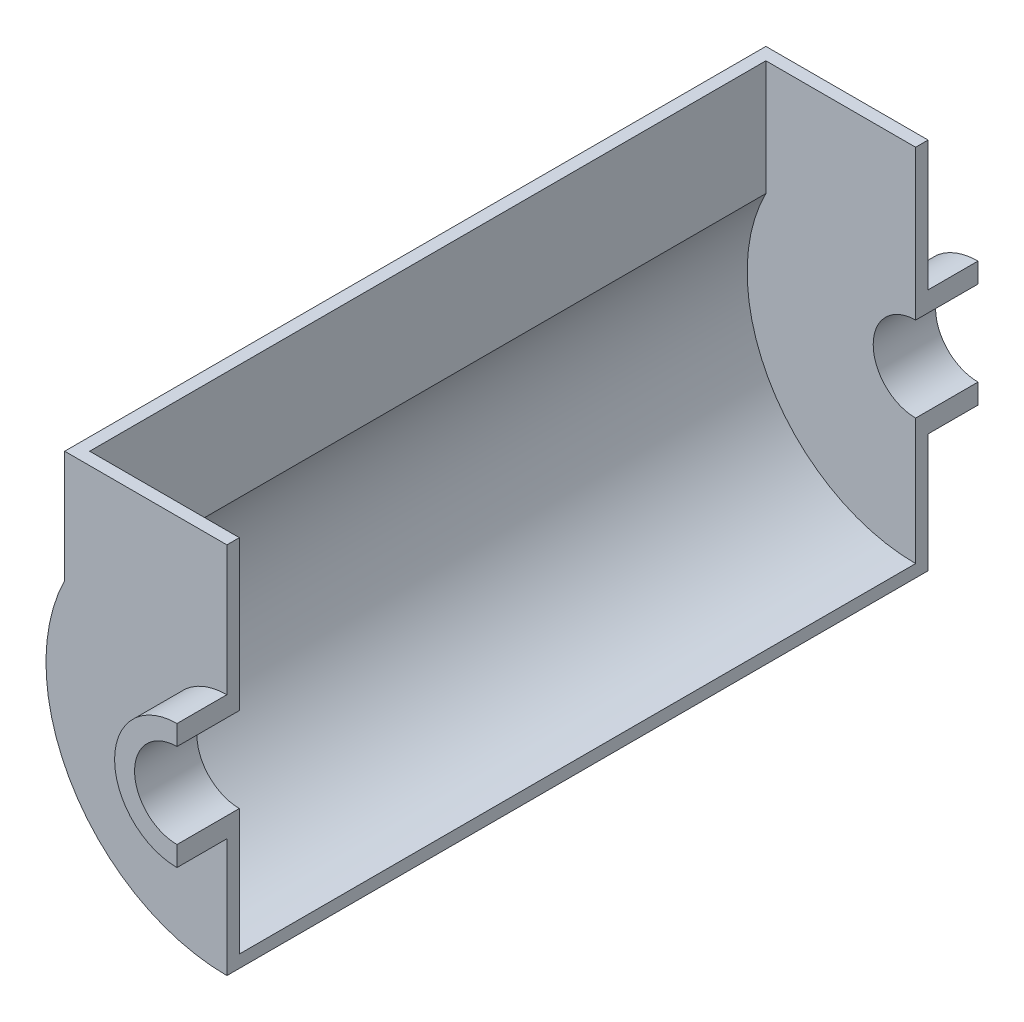
ISO-10303-21;
HEADER;
FILE_DESCRIPTION(('STEP AP214'),'2;1');
FILE_NAME('part.step','',(''),(''),'','','');
FILE_SCHEMA(('AUTOMOTIVE_DESIGN { 1 0 10303 214 1 1 1 1 }'));
ENDSEC;
DATA;
#1=APPLICATION_CONTEXT('core data for automotive mechanical design processes');
#2=APPLICATION_PROTOCOL_DEFINITION('international standard','automotive_design',2000,#1);
#3=PRODUCT_CONTEXT('',#1,'mechanical');
#4=PRODUCT('Part','Part','',(#3));
#5=PRODUCT_RELATED_PRODUCT_CATEGORY('part','',(#4));
#6=PRODUCT_DEFINITION_FORMATION('','',#4);
#7=PRODUCT_DEFINITION_CONTEXT('part definition',#1,'design');
#8=PRODUCT_DEFINITION('design','',#6,#7);
#9=PRODUCT_DEFINITION_SHAPE('','',#8);
#10=(LENGTH_UNIT() NAMED_UNIT(*) SI_UNIT(.MILLI.,.METRE.));
#11=(NAMED_UNIT(*) PLANE_ANGLE_UNIT() SI_UNIT($,.RADIAN.));
#12=(NAMED_UNIT(*) SI_UNIT($,.STERADIAN.) SOLID_ANGLE_UNIT());
#13=UNCERTAINTY_MEASURE_WITH_UNIT(LENGTH_MEASURE(1.E-05),#10,'distance_accuracy_value','');
#14=(GEOMETRIC_REPRESENTATION_CONTEXT(3) GLOBAL_UNCERTAINTY_ASSIGNED_CONTEXT((#13)) GLOBAL_UNIT_ASSIGNED_CONTEXT((#10,
#11,#12)) REPRESENTATION_CONTEXT('',''));
#15=CARTESIAN_POINT('',(0.,0.,0.));
#16=DIRECTION('',(0.,0.,1.));
#17=DIRECTION('',(1.,0.,0.));
#18=AXIS2_PLACEMENT_3D('',#15,#16,#17);
#19=CARTESIAN_POINT('',(0.,0.,-5.));
#20=DIRECTION('',(0.,0.,1.));
#21=DIRECTION('',(1.,0.,0.));
#22=AXIS2_PLACEMENT_3D('',#19,#20,#21);
#23=PLANE('',#22);
#24=CARTESIAN_POINT('',(0.,0.,-5.));
#25=DIRECTION('',(0.,0.,1.));
#26=DIRECTION('',(-1.,0.,0.));
#27=AXIS2_PLACEMENT_3D('',#24,#25,#26);
#28=CIRCLE('',#27,67.5);
#29=CARTESIAN_POINT('',(-60.,30.9232921921324,-5.));
#30=VERTEX_POINT('',#29);
#31=CARTESIAN_POINT('',(0.,-67.5,-5.));
#32=VERTEX_POINT('',#31);
#33=EDGE_CURVE('E209',#30,#32,#28,.T.);
#34=ORIENTED_EDGE('',*,*,#33,.F.);
#35=DIRECTION('',(0.,-1.,0.));
#36=VECTOR('',#35,1.);
#37=CARTESIAN_POINT('',(-60.,77.,-5.));
#38=LINE('',#37,#36);
#39=CARTESIAN_POINT('',(-60.,77.,-5.));
#40=VERTEX_POINT('',#39);
#41=EDGE_CURVE('E57',#40,#30,#38,.T.);
#42=ORIENTED_EDGE('',*,*,#41,.F.);
#43=DIRECTION('',(-1.,0.,0.));
#44=VECTOR('',#43,1.);
#45=CARTESIAN_POINT('',(0.,77.,-5.));
#46=LINE('',#45,#44);
#47=CARTESIAN_POINT('',(0.,77.,-5.));
#48=VERTEX_POINT('',#47);
#49=EDGE_CURVE('E232',#48,#40,#46,.T.);
#50=ORIENTED_EDGE('',*,*,#49,.F.);
#51=DIRECTION('',(0.,1.,0.));
#52=VECTOR('',#51,1.);
#53=CARTESIAN_POINT('',(0.,25.,-5.));
#54=LINE('',#53,#52);
#55=CARTESIAN_POINT('',(0.,17.,-5.));
#56=VERTEX_POINT('',#55);
#57=EDGE_CURVE('E290',#56,#48,#54,.T.);
#58=ORIENTED_EDGE('',*,*,#57,.F.);
#59=CARTESIAN_POINT('',(0.,0.,-5.));
#60=DIRECTION('',(0.,0.,-1.));
#61=DIRECTION('',(1.,0.,0.));
#62=AXIS2_PLACEMENT_3D('',#59,#60,#61);
#63=CIRCLE('',#62,17.);
#64=CARTESIAN_POINT('',(0.,-17.,-5.));
#65=VERTEX_POINT('',#64);
#66=EDGE_CURVE('E286',#65,#56,#63,.T.);
#67=ORIENTED_EDGE('',*,*,#66,.F.);
#68=DIRECTION('',(0.,1.,0.));
#69=VECTOR('',#68,1.);
#70=CARTESIAN_POINT('',(0.,-17.,-5.));
#71=LINE('',#70,#69);
#72=EDGE_CURVE('E63',#32,#65,#71,.T.);
#73=ORIENTED_EDGE('',*,*,#72,.F.);
#74=EDGE_LOOP('',(#34,#42,#50,#58,#67,#73));
#75=FACE_BOUND('',#74,.T.);
#76=ADVANCED_FACE('F39',(#75),#23,.F.);
#77=CARTESIAN_POINT('',(0.,0.,-5.));
#78=DIRECTION('',(0.,0.,1.));
#79=DIRECTION('',(1.,0.,0.));
#80=AXIS2_PLACEMENT_3D('',#77,#78,#79);
#81=CYLINDRICAL_SURFACE('',#80,17.);
#82=DIRECTION('',(0.,0.,1.));
#83=VECTOR('',#82,1.);
#84=CARTESIAN_POINT('',(0.,17.,-5.));
#85=LINE('',#84,#83);
#86=CARTESIAN_POINT('',(0.,17.,20.));
#87=VERTEX_POINT('',#86);
#88=EDGE_CURVE('E43',#56,#87,#85,.T.);
#89=ORIENTED_EDGE('',*,*,#88,.T.);
#90=CARTESIAN_POINT('',(0.,0.,20.));
#91=DIRECTION('',(0.,0.,-1.));
#92=DIRECTION('',(1.,0.,0.));
#93=AXIS2_PLACEMENT_3D('',#90,#91,#92);
#94=CIRCLE('',#93,17.);
#95=CARTESIAN_POINT('',(0.,-17.,20.));
#96=VERTEX_POINT('',#95);
#97=EDGE_CURVE('E262',#96,#87,#94,.T.);
#98=ORIENTED_EDGE('',*,*,#97,.F.);
#99=DIRECTION('',(0.,0.,1.));
#100=VECTOR('',#99,1.);
#101=CARTESIAN_POINT('',(0.,-17.,-5.));
#102=LINE('',#101,#100);
#103=EDGE_CURVE('E11',#65,#96,#102,.T.);
#104=ORIENTED_EDGE('',*,*,#103,.F.);
#105=ORIENTED_EDGE('',*,*,#66,.T.);
#106=EDGE_LOOP('',(#89,#98,#104,#105));
#107=FACE_BOUND('',#106,.T.);
#108=ADVANCED_FACE('F41',(#107),#81,.F.);
#109=CARTESIAN_POINT('',(0.,-17.,-5.));
#110=DIRECTION('',(1.,0.,0.));
#111=DIRECTION('',(0.,0.,-1.));
#112=AXIS2_PLACEMENT_3D('',#109,#110,#111);
#113=PLANE('',#112);
#114=ORIENTED_EDGE('',*,*,#103,.T.);
#115=DIRECTION('',(0.,1.,0.));
#116=VECTOR('',#115,1.);
#117=CARTESIAN_POINT('',(0.,-17.,20.));
#118=LINE('',#117,#116);
#119=CARTESIAN_POINT('',(0.,-25.,20.));
#120=VERTEX_POINT('',#119);
#121=EDGE_CURVE('E282',#120,#96,#118,.T.);
#122=ORIENTED_EDGE('',*,*,#121,.F.);
#123=DIRECTION('',(0.,0.,1.));
#124=VECTOR('',#123,1.);
#125=CARTESIAN_POINT('',(0.,-25.,-5.));
#126=LINE('',#125,#124);
#127=CARTESIAN_POINT('',(0.,-25.,0.));
#128=VERTEX_POINT('',#127);
#129=EDGE_CURVE('E49',#128,#120,#126,.T.);
#130=ORIENTED_EDGE('',*,*,#129,.F.);
#131=DIRECTION('',(0.,1.,0.));
#132=VECTOR('',#131,1.);
#133=CARTESIAN_POINT('',(0.,-25.,0.));
#134=LINE('',#133,#132);
#135=CARTESIAN_POINT('',(0.,-72.5,0.));
#136=VERTEX_POINT('',#135);
#137=EDGE_CURVE('E236',#136,#128,#134,.T.);
#138=ORIENTED_EDGE('',*,*,#137,.F.);
#139=DIRECTION('',(0.,0.,1.));
#140=VECTOR('',#139,1.);
#141=CARTESIAN_POINT('',(0.,-72.5,-5.));
#142=LINE('',#141,#140);
#143=CARTESIAN_POINT('',(0.,-72.5,-281.));
#144=VERTEX_POINT('',#143);
#145=EDGE_CURVE('E259',#144,#136,#142,.T.);
#146=ORIENTED_EDGE('',*,*,#145,.F.);
#147=DIRECTION('',(0.,1.,0.));
#148=VECTOR('',#147,1.);
#149=CARTESIAN_POINT('',(0.,-25.,-281.));
#150=LINE('',#149,#148);
#151=CARTESIAN_POINT('',(0.,-25.,-281.));
#152=VERTEX_POINT('',#151);
#153=EDGE_CURVE('E168',#144,#152,#150,.T.);
#154=ORIENTED_EDGE('',*,*,#153,.T.);
#155=DIRECTION('',(0.,0.,-1.));
#156=VECTOR('',#155,1.);
#157=CARTESIAN_POINT('',(0.,-25.,-276.));
#158=LINE('',#157,#156);
#159=CARTESIAN_POINT('',(0.,-25.,-301.));
#160=VERTEX_POINT('',#159);
#161=EDGE_CURVE('E199',#152,#160,#158,.T.);
#162=ORIENTED_EDGE('',*,*,#161,.T.);
#163=DIRECTION('',(0.,1.,0.));
#164=VECTOR('',#163,1.);
#165=CARTESIAN_POINT('',(0.,-17.,-301.));
#166=LINE('',#165,#164);
#167=CARTESIAN_POINT('',(0.,-17.,-301.));
#168=VERTEX_POINT('',#167);
#169=EDGE_CURVE('E191',#160,#168,#166,.T.);
#170=ORIENTED_EDGE('',*,*,#169,.T.);
#171=DIRECTION('',(0.,0.,-1.));
#172=VECTOR('',#171,1.);
#173=CARTESIAN_POINT('',(0.,-17.,-276.));
#174=LINE('',#173,#172);
#175=CARTESIAN_POINT('',(0.,-17.,-276.));
#176=VERTEX_POINT('',#175);
#177=EDGE_CURVE('E195',#176,#168,#174,.T.);
#178=ORIENTED_EDGE('',*,*,#177,.F.);
#179=DIRECTION('',(0.,1.,0.));
#180=VECTOR('',#179,1.);
#181=CARTESIAN_POINT('',(0.,-17.,-276.));
#182=LINE('',#181,#180);
#183=CARTESIAN_POINT('',(0.,-67.5,-276.));
#184=VERTEX_POINT('',#183);
#185=EDGE_CURVE('E185',#184,#176,#182,.T.);
#186=ORIENTED_EDGE('',*,*,#185,.F.);
#187=DIRECTION('',(0.,0.,1.));
#188=VECTOR('',#187,1.);
#189=CARTESIAN_POINT('',(0.,-67.5,-442.152038807834));
#190=LINE('',#189,#188);
#191=EDGE_CURVE('E213',#184,#32,#190,.T.);
#192=ORIENTED_EDGE('',*,*,#191,.T.);
#193=ORIENTED_EDGE('',*,*,#72,.T.);
#194=EDGE_LOOP('',(#114,#122,#130,#138,#146,#154,#162,#170,#178,#186,#192,#193));
#195=FACE_BOUND('',#194,.T.);
#196=ADVANCED_FACE('F313',(#195),#113,.T.);
#197=CARTESIAN_POINT('',(0.,0.,-5.));
#198=DIRECTION('',(0.,0.,1.));
#199=DIRECTION('',(1.,0.,0.));
#200=AXIS2_PLACEMENT_3D('',#197,#198,#199);
#201=CYLINDRICAL_SURFACE('',#200,25.);
#202=CARTESIAN_POINT('',(0.,0.,0.));
#203=DIRECTION('',(0.,0.,-1.));
#204=DIRECTION('',(1.,0.,0.));
#205=AXIS2_PLACEMENT_3D('',#202,#203,#204);
#206=CIRCLE('',#205,25.);
#207=CARTESIAN_POINT('',(0.,25.,0.));
#208=VERTEX_POINT('',#207);
#209=EDGE_CURVE('E221',#128,#208,#206,.T.);
#210=ORIENTED_EDGE('',*,*,#209,.F.);
#211=ORIENTED_EDGE('',*,*,#129,.T.);
#212=CARTESIAN_POINT('',(0.,0.,20.));
#213=DIRECTION('',(0.,0.,1.));
#214=DIRECTION('',(1.,0.,0.));
#215=AXIS2_PLACEMENT_3D('',#212,#213,#214);
#216=CIRCLE('',#215,25.);
#217=CARTESIAN_POINT('',(0.,25.,20.));
#218=VERTEX_POINT('',#217);
#219=EDGE_CURVE('E278',#218,#120,#216,.T.);
#220=ORIENTED_EDGE('',*,*,#219,.F.);
#221=DIRECTION('',(0.,0.,1.));
#222=VECTOR('',#221,1.);
#223=CARTESIAN_POINT('',(0.,25.,-5.));
#224=LINE('',#223,#222);
#225=EDGE_CURVE('E296',#208,#218,#224,.T.);
#226=ORIENTED_EDGE('',*,*,#225,.F.);
#227=EDGE_LOOP('',(#210,#211,#220,#226));
#228=FACE_BOUND('',#227,.T.);
#229=ADVANCED_FACE('F320',(#228),#201,.T.);
#230=CARTESIAN_POINT('',(0.,25.,-5.));
#231=DIRECTION('',(1.,0.,0.));
#232=DIRECTION('',(0.,0.,-1.));
#233=AXIS2_PLACEMENT_3D('',#230,#231,#232);
#234=PLANE('',#233);
#235=ORIENTED_EDGE('',*,*,#57,.T.);
#236=DIRECTION('',(0.,0.,1.));
#237=VECTOR('',#236,1.);
#238=CARTESIAN_POINT('',(0.,77.,-5.));
#239=LINE('',#238,#237);
#240=CARTESIAN_POINT('',(0.,77.,0.));
#241=VERTEX_POINT('',#240);
#242=EDGE_CURVE('E235',#48,#241,#239,.T.);
#243=ORIENTED_EDGE('',*,*,#242,.T.);
#244=DIRECTION('',(0.,1.,0.));
#245=VECTOR('',#244,1.);
#246=CARTESIAN_POINT('',(0.,25.,0.));
#247=LINE('',#246,#245);
#248=EDGE_CURVE('E240',#208,#241,#247,.T.);
#249=ORIENTED_EDGE('',*,*,#248,.F.);
#250=ORIENTED_EDGE('',*,*,#225,.T.);
#251=DIRECTION('',(0.,1.,0.));
#252=VECTOR('',#251,1.);
#253=CARTESIAN_POINT('',(0.,25.,20.));
#254=LINE('',#253,#252);
#255=EDGE_CURVE('E274',#87,#218,#254,.T.);
#256=ORIENTED_EDGE('',*,*,#255,.F.);
#257=ORIENTED_EDGE('',*,*,#88,.F.);
#258=EDGE_LOOP('',(#235,#243,#249,#250,#256,#257));
#259=FACE_BOUND('',#258,.T.);
#260=ADVANCED_FACE('F306',(#259),#234,.T.);
#261=CARTESIAN_POINT('',(0.,0.,20.));
#262=DIRECTION('',(0.,0.,1.));
#263=DIRECTION('',(1.,0.,0.));
#264=AXIS2_PLACEMENT_3D('',#261,#262,#263);
#265=PLANE('',#264);
#266=ORIENTED_EDGE('',*,*,#97,.T.);
#267=ORIENTED_EDGE('',*,*,#255,.T.);
#268=ORIENTED_EDGE('',*,*,#219,.T.);
#269=ORIENTED_EDGE('',*,*,#121,.T.);
#270=EDGE_LOOP('',(#266,#267,#268,#269));
#271=FACE_BOUND('',#270,.T.);
#272=ADVANCED_FACE('F309',(#271),#265,.T.);
#273=CARTESIAN_POINT('',(0.,0.,-5.));
#274=DIRECTION('',(0.,0.,1.));
#275=DIRECTION('',(1.,0.,0.));
#276=AXIS2_PLACEMENT_3D('',#273,#274,#275);
#277=CYLINDRICAL_SURFACE('',#276,72.5);
#278=CARTESIAN_POINT('',(0.,0.,0.));
#279=DIRECTION('',(0.,0.,1.));
#280=DIRECTION('',(1.,0.,0.));
#281=AXIS2_PLACEMENT_3D('',#278,#279,#280);
#282=CIRCLE('',#281,72.5);
#283=CARTESIAN_POINT('',(-65.,32.1130814466628,0.));
#284=VERTEX_POINT('',#283);
#285=EDGE_CURVE('E252',#284,#136,#282,.T.);
#286=ORIENTED_EDGE('',*,*,#285,.F.);
#287=DIRECTION('',(0.,0.,1.));
#288=VECTOR('',#287,1.);
#289=CARTESIAN_POINT('',(-65.,32.1130814466628,-5.));
#290=LINE('',#289,#288);
#291=CARTESIAN_POINT('',(-65.,32.1130814466628,-281.));
#292=VERTEX_POINT('',#291);
#293=EDGE_CURVE('E263',#292,#284,#290,.T.);
#294=ORIENTED_EDGE('',*,*,#293,.F.);
#295=CARTESIAN_POINT('',(0.,0.,-281.));
#296=DIRECTION('',(0.,0.,1.));
#297=DIRECTION('',(1.,0.,0.));
#298=AXIS2_PLACEMENT_3D('',#295,#296,#297);
#299=CIRCLE('',#298,72.5);
#300=EDGE_CURVE('E390',#292,#144,#299,.T.);
#301=ORIENTED_EDGE('',*,*,#300,.T.);
#302=ORIENTED_EDGE('',*,*,#145,.T.);
#303=EDGE_LOOP('',(#286,#294,#301,#302));
#304=FACE_BOUND('',#303,.T.);
#305=ADVANCED_FACE('F336',(#304),#277,.T.);
#306=CARTESIAN_POINT('',(-65.,77.,-5.));
#307=DIRECTION('',(-1.,0.,0.));
#308=DIRECTION('',(0.,-1.,0.));
#309=AXIS2_PLACEMENT_3D('',#306,#307,#308);
#310=PLANE('',#309);
#311=DIRECTION('',(0.,-1.,0.));
#312=VECTOR('',#311,1.);
#313=CARTESIAN_POINT('',(-65.,77.,0.));
#314=LINE('',#313,#312);
#315=CARTESIAN_POINT('',(-65.,77.,0.));
#316=VERTEX_POINT('',#315);
#317=EDGE_CURVE('E248',#316,#284,#314,.T.);
#318=ORIENTED_EDGE('',*,*,#317,.F.);
#319=DIRECTION('',(0.,0.,1.));
#320=VECTOR('',#319,1.);
#321=CARTESIAN_POINT('',(-65.,77.,-5.));
#322=LINE('',#321,#320);
#323=CARTESIAN_POINT('',(-65.,77.,-281.));
#324=VERTEX_POINT('',#323);
#325=EDGE_CURVE('E266',#324,#316,#322,.T.);
#326=ORIENTED_EDGE('',*,*,#325,.F.);
#327=DIRECTION('',(0.,-1.,0.));
#328=VECTOR('',#327,1.);
#329=CARTESIAN_POINT('',(-65.,77.,-281.));
#330=LINE('',#329,#328);
#331=EDGE_CURVE('E393',#324,#292,#330,.T.);
#332=ORIENTED_EDGE('',*,*,#331,.T.);
#333=ORIENTED_EDGE('',*,*,#293,.T.);
#334=EDGE_LOOP('',(#318,#326,#332,#333));
#335=FACE_BOUND('',#334,.T.);
#336=ADVANCED_FACE('F339',(#335),#310,.T.);
#337=CARTESIAN_POINT('',(0.,77.,-5.));
#338=DIRECTION('',(0.,1.,0.));
#339=DIRECTION('',(-1.,0.,0.));
#340=AXIS2_PLACEMENT_3D('',#337,#338,#339);
#341=PLANE('',#340);
#342=DIRECTION('',(-1.,0.,0.));
#343=VECTOR('',#342,1.);
#344=CARTESIAN_POINT('',(0.,77.,0.));
#345=LINE('',#344,#343);
#346=EDGE_CURVE('E244',#241,#316,#345,.T.);
#347=ORIENTED_EDGE('',*,*,#346,.F.);
#348=ORIENTED_EDGE('',*,*,#242,.F.);
#349=ORIENTED_EDGE('',*,*,#49,.T.);
#350=DIRECTION('',(0.,0.,1.));
#351=VECTOR('',#350,1.);
#352=CARTESIAN_POINT('',(-60.,77.,-442.152038807834));
#353=LINE('',#352,#351);
#354=CARTESIAN_POINT('',(-60.,77.,-276.));
#355=VERTEX_POINT('',#354);
#356=EDGE_CURVE('E163',#355,#40,#353,.T.);
#357=ORIENTED_EDGE('',*,*,#356,.F.);
#358=DIRECTION('',(-1.,0.,0.));
#359=VECTOR('',#358,1.);
#360=CARTESIAN_POINT('',(0.,77.,-276.));
#361=LINE('',#360,#359);
#362=CARTESIAN_POINT('',(0.,77.,-276.));
#363=VERTEX_POINT('',#362);
#364=EDGE_CURVE('E155',#363,#355,#361,.T.);
#365=ORIENTED_EDGE('',*,*,#364,.F.);
#366=DIRECTION('',(0.,0.,-1.));
#367=VECTOR('',#366,1.);
#368=CARTESIAN_POINT('',(0.,77.,-276.));
#369=LINE('',#368,#367);
#370=CARTESIAN_POINT('',(0.,77.,-281.));
#371=VERTEX_POINT('',#370);
#372=EDGE_CURVE('E160',#363,#371,#369,.T.);
#373=ORIENTED_EDGE('',*,*,#372,.T.);
#374=DIRECTION('',(-1.,0.,0.));
#375=VECTOR('',#374,1.);
#376=CARTESIAN_POINT('',(0.,77.,-281.));
#377=LINE('',#376,#375);
#378=EDGE_CURVE('E412',#371,#324,#377,.T.);
#379=ORIENTED_EDGE('',*,*,#378,.T.);
#380=ORIENTED_EDGE('',*,*,#325,.T.);
#381=EDGE_LOOP('',(#347,#348,#349,#357,#365,#373,#379,#380));
#382=FACE_BOUND('',#381,.T.);
#383=ADVANCED_FACE('F158',(#382),#341,.T.);
#384=CARTESIAN_POINT('',(0.,0.,0.));
#385=DIRECTION('',(0.,0.,1.));
#386=DIRECTION('',(1.,0.,0.));
#387=AXIS2_PLACEMENT_3D('',#384,#385,#386);
#388=PLANE('',#387);
#389=ORIENTED_EDGE('',*,*,#209,.T.);
#390=ORIENTED_EDGE('',*,*,#248,.T.);
#391=ORIENTED_EDGE('',*,*,#346,.T.);
#392=ORIENTED_EDGE('',*,*,#317,.T.);
#393=ORIENTED_EDGE('',*,*,#285,.T.);
#394=ORIENTED_EDGE('',*,*,#137,.T.);
#395=EDGE_LOOP('',(#389,#390,#391,#392,#393,#394));
#396=FACE_BOUND('',#395,.T.);
#397=ADVANCED_FACE('F318',(#396),#388,.T.);
#398=CARTESIAN_POINT('',(-60.,77.,-442.152038807834));
#399=DIRECTION('',(-1.,0.,0.));
#400=DIRECTION('',(0.,0.,1.));
#401=AXIS2_PLACEMENT_3D('',#398,#399,#400);
#402=PLANE('',#401);
#403=DIRECTION('',(0.,-1.,0.));
#404=VECTOR('',#403,1.);
#405=CARTESIAN_POINT('',(-60.,77.,-276.));
#406=LINE('',#405,#404);
#407=CARTESIAN_POINT('',(-60.,30.9232921921324,-276.));
#408=VERTEX_POINT('',#407);
#409=EDGE_CURVE('E222',#355,#408,#406,.T.);
#410=ORIENTED_EDGE('',*,*,#409,.F.);
#411=ORIENTED_EDGE('',*,*,#356,.T.);
#412=ORIENTED_EDGE('',*,*,#41,.T.);
#413=DIRECTION('',(0.,0.,1.));
#414=VECTOR('',#413,1.);
#415=CARTESIAN_POINT('',(-60.,30.9232921921324,-442.152038807834));
#416=LINE('',#415,#414);
#417=EDGE_CURVE('E214',#408,#30,#416,.T.);
#418=ORIENTED_EDGE('',*,*,#417,.F.);
#419=EDGE_LOOP('',(#410,#411,#412,#418));
#420=FACE_BOUND('',#419,.T.);
#421=ADVANCED_FACE('F348',(#420),#402,.F.);
#422=CARTESIAN_POINT('',(0.,0.,-442.152038807834));
#423=DIRECTION('',(0.,0.,1.));
#424=DIRECTION('',(1.,0.,0.));
#425=AXIS2_PLACEMENT_3D('',#422,#423,#424);
#426=CYLINDRICAL_SURFACE('',#425,67.5);
#427=CARTESIAN_POINT('',(0.,0.,-276.));
#428=DIRECTION('',(0.,0.,-1.));
#429=DIRECTION('',(-1.,0.,0.));
#430=AXIS2_PLACEMENT_3D('',#427,#428,#429);
#431=CIRCLE('',#430,67.5);
#432=EDGE_CURVE('E217',#408,#184,#431,.F.);
#433=ORIENTED_EDGE('',*,*,#432,.F.);
#434=ORIENTED_EDGE('',*,*,#417,.T.);
#435=ORIENTED_EDGE('',*,*,#33,.T.);
#436=ORIENTED_EDGE('',*,*,#191,.F.);
#437=EDGE_LOOP('',(#433,#434,#435,#436));
#438=FACE_BOUND('',#437,.T.);
#439=ADVANCED_FACE('F351',(#438),#426,.F.);
#440=CARTESIAN_POINT('',(0.,0.,-276.));
#441=DIRECTION('',(0.,0.,-1.));
#442=DIRECTION('',(1.,0.,0.));
#443=AXIS2_PLACEMENT_3D('',#440,#441,#442);
#444=PLANE('',#443);
#445=ORIENTED_EDGE('',*,*,#364,.T.);
#446=ORIENTED_EDGE('',*,*,#409,.T.);
#447=ORIENTED_EDGE('',*,*,#432,.T.);
#448=ORIENTED_EDGE('',*,*,#185,.T.);
#449=CARTESIAN_POINT('',(0.,0.,-276.));
#450=DIRECTION('',(0.,0.,-1.));
#451=DIRECTION('',(1.,0.,0.));
#452=AXIS2_PLACEMENT_3D('',#449,#450,#451);
#453=CIRCLE('',#452,17.);
#454=CARTESIAN_POINT('',(0.,17.,-276.));
#455=VERTEX_POINT('',#454);
#456=EDGE_CURVE('E182',#176,#455,#453,.T.);
#457=ORIENTED_EDGE('',*,*,#456,.T.);
#458=DIRECTION('',(0.,1.,0.));
#459=VECTOR('',#458,1.);
#460=CARTESIAN_POINT('',(0.,25.,-276.));
#461=LINE('',#460,#459);
#462=EDGE_CURVE('E173',#455,#363,#461,.T.);
#463=ORIENTED_EDGE('',*,*,#462,.T.);
#464=EDGE_LOOP('',(#445,#446,#447,#448,#457,#463));
#465=FACE_BOUND('',#464,.T.);
#466=ADVANCED_FACE('F180',(#465),#444,.F.);
#467=CARTESIAN_POINT('',(0.,0.,-276.));
#468=DIRECTION('',(0.,0.,-1.));
#469=DIRECTION('',(1.,0.,0.));
#470=AXIS2_PLACEMENT_3D('',#467,#468,#469);
#471=CYLINDRICAL_SURFACE('',#470,17.);
#472=DIRECTION('',(0.,0.,-1.));
#473=VECTOR('',#472,1.);
#474=CARTESIAN_POINT('',(0.,17.,-276.));
#475=LINE('',#474,#473);
#476=CARTESIAN_POINT('',(0.,17.,-301.));
#477=VERTEX_POINT('',#476);
#478=EDGE_CURVE('E189',#455,#477,#475,.T.);
#479=ORIENTED_EDGE('',*,*,#478,.F.);
#480=ORIENTED_EDGE('',*,*,#456,.F.);
#481=ORIENTED_EDGE('',*,*,#177,.T.);
#482=CARTESIAN_POINT('',(0.,0.,-301.));
#483=DIRECTION('',(0.,0.,-1.));
#484=DIRECTION('',(1.,0.,0.));
#485=AXIS2_PLACEMENT_3D('',#482,#483,#484);
#486=CIRCLE('',#485,17.);
#487=EDGE_CURVE('E178',#168,#477,#486,.T.);
#488=ORIENTED_EDGE('',*,*,#487,.T.);
#489=EDGE_LOOP('',(#479,#480,#481,#488));
#490=FACE_BOUND('',#489,.T.);
#491=ADVANCED_FACE('F356',(#490),#471,.F.);
#492=CARTESIAN_POINT('',(0.,0.,-276.));
#493=DIRECTION('',(0.,0.,-1.));
#494=DIRECTION('',(1.,0.,0.));
#495=AXIS2_PLACEMENT_3D('',#492,#493,#494);
#496=CYLINDRICAL_SURFACE('',#495,25.);
#497=CARTESIAN_POINT('',(0.,0.,-281.));
#498=DIRECTION('',(0.,0.,-1.));
#499=DIRECTION('',(1.,0.,0.));
#500=AXIS2_PLACEMENT_3D('',#497,#498,#499);
#501=CIRCLE('',#500,25.);
#502=CARTESIAN_POINT('',(0.,25.,-281.));
#503=VERTEX_POINT('',#502);
#504=EDGE_CURVE('E379',#152,#503,#501,.T.);
#505=ORIENTED_EDGE('',*,*,#504,.T.);
#506=DIRECTION('',(0.,0.,-1.));
#507=VECTOR('',#506,1.);
#508=CARTESIAN_POINT('',(0.,25.,-276.));
#509=LINE('',#508,#507);
#510=CARTESIAN_POINT('',(0.,25.,-301.));
#511=VERTEX_POINT('',#510);
#512=EDGE_CURVE('E203',#503,#511,#509,.T.);
#513=ORIENTED_EDGE('',*,*,#512,.T.);
#514=CARTESIAN_POINT('',(0.,0.,-301.));
#515=DIRECTION('',(0.,0.,1.));
#516=DIRECTION('',(1.,0.,0.));
#517=AXIS2_PLACEMENT_3D('',#514,#515,#516);
#518=CIRCLE('',#517,25.);
#519=EDGE_CURVE('E386',#511,#160,#518,.T.);
#520=ORIENTED_EDGE('',*,*,#519,.T.);
#521=ORIENTED_EDGE('',*,*,#161,.F.);
#522=EDGE_LOOP('',(#505,#513,#520,#521));
#523=FACE_BOUND('',#522,.T.);
#524=ADVANCED_FACE('F359',(#523),#496,.T.);
#525=CARTESIAN_POINT('',(0.,25.,-276.));
#526=DIRECTION('',(1.,0.,0.));
#527=DIRECTION('',(0.,0.,1.));
#528=AXIS2_PLACEMENT_3D('',#525,#526,#527);
#529=PLANE('',#528);
#530=ORIENTED_EDGE('',*,*,#462,.F.);
#531=ORIENTED_EDGE('',*,*,#478,.T.);
#532=DIRECTION('',(0.,1.,0.));
#533=VECTOR('',#532,1.);
#534=CARTESIAN_POINT('',(0.,25.,-301.));
#535=LINE('',#534,#533);
#536=EDGE_CURVE('E400',#477,#511,#535,.T.);
#537=ORIENTED_EDGE('',*,*,#536,.T.);
#538=ORIENTED_EDGE('',*,*,#512,.F.);
#539=DIRECTION('',(0.,1.,0.));
#540=VECTOR('',#539,1.);
#541=CARTESIAN_POINT('',(0.,25.,-281.));
#542=LINE('',#541,#540);
#543=EDGE_CURVE('E176',#503,#371,#542,.T.);
#544=ORIENTED_EDGE('',*,*,#543,.T.);
#545=ORIENTED_EDGE('',*,*,#372,.F.);
#546=EDGE_LOOP('',(#530,#531,#537,#538,#544,#545));
#547=FACE_BOUND('',#546,.T.);
#548=ADVANCED_FACE('F171',(#547),#529,.T.);
#549=CARTESIAN_POINT('',(0.,0.,-301.));
#550=DIRECTION('',(0.,0.,-1.));
#551=DIRECTION('',(1.,0.,0.));
#552=AXIS2_PLACEMENT_3D('',#549,#550,#551);
#553=PLANE('',#552);
#554=ORIENTED_EDGE('',*,*,#487,.F.);
#555=ORIENTED_EDGE('',*,*,#169,.F.);
#556=ORIENTED_EDGE('',*,*,#519,.F.);
#557=ORIENTED_EDGE('',*,*,#536,.F.);
#558=EDGE_LOOP('',(#554,#555,#556,#557));
#559=FACE_BOUND('',#558,.T.);
#560=ADVANCED_FACE('F363',(#559),#553,.T.);
#561=CARTESIAN_POINT('',(0.,0.,-281.));
#562=DIRECTION('',(0.,0.,-1.));
#563=DIRECTION('',(1.,0.,0.));
#564=AXIS2_PLACEMENT_3D('',#561,#562,#563);
#565=PLANE('',#564);
#566=ORIENTED_EDGE('',*,*,#504,.F.);
#567=ORIENTED_EDGE('',*,*,#153,.F.);
#568=ORIENTED_EDGE('',*,*,#300,.F.);
#569=ORIENTED_EDGE('',*,*,#331,.F.);
#570=ORIENTED_EDGE('',*,*,#378,.F.);
#571=ORIENTED_EDGE('',*,*,#543,.F.);
#572=EDGE_LOOP('',(#566,#567,#568,#569,#570,#571));
#573=FACE_BOUND('',#572,.T.);
#574=ADVANCED_FACE('F371',(#573),#565,.T.);
#575=CLOSED_SHELL('',(#76,#108,#196,#229,#260,#272,#305,#336,#383,#397,#421,#439,#466,#491,#524,
#548,#560,#574));
#576=MANIFOLD_SOLID_BREP('B2',#575);
#577=ADVANCED_BREP_SHAPE_REPRESENTATION('',(#18,#576),#14);
#578=SHAPE_DEFINITION_REPRESENTATION(#9,#577);
ENDSEC;
END-ISO-10303-21;
